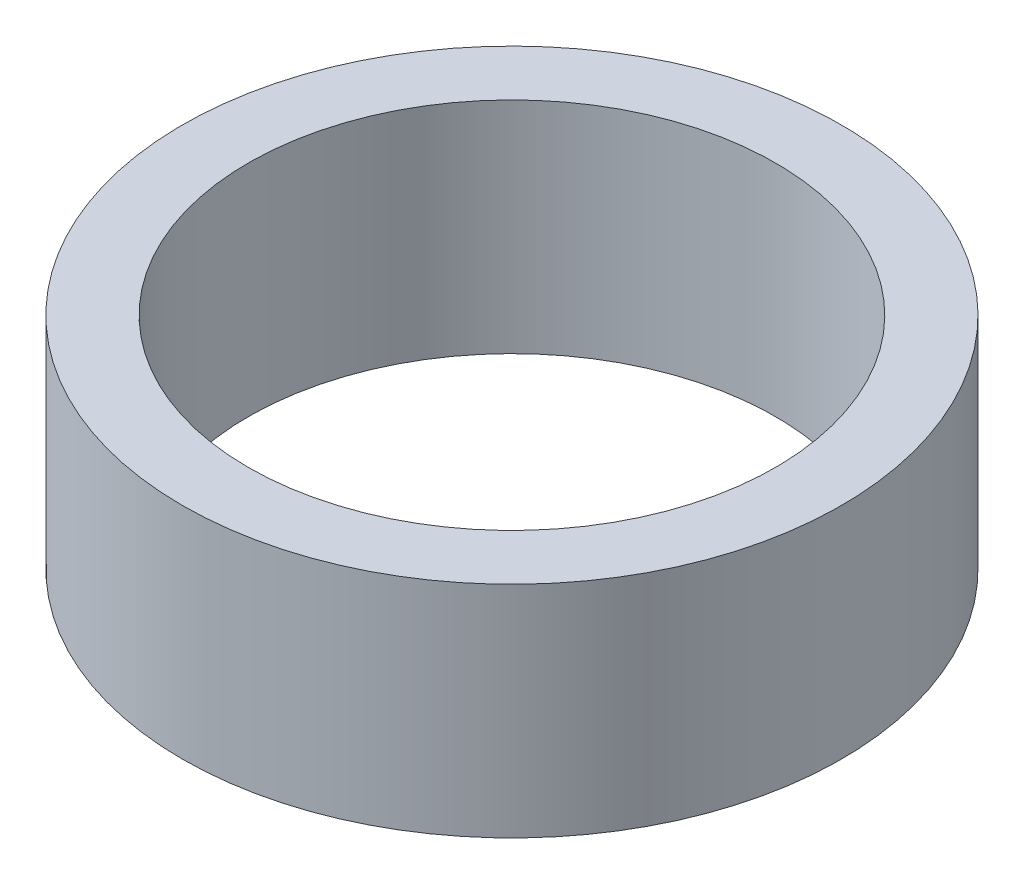
ISO-10303-21;
HEADER;
FILE_DESCRIPTION(('STEP AP214'),'2;1');
FILE_NAME('part.step','',(''),(''),'','','');
FILE_SCHEMA(('AUTOMOTIVE_DESIGN { 1 0 10303 214 1 1 1 1 }'));
ENDSEC;
DATA;
#1=APPLICATION_CONTEXT('core data for automotive mechanical design processes');
#2=APPLICATION_PROTOCOL_DEFINITION('international standard','automotive_design',2000,#1);
#3=PRODUCT_CONTEXT('',#1,'mechanical');
#4=PRODUCT('Part','Part','',(#3));
#5=PRODUCT_RELATED_PRODUCT_CATEGORY('part','',(#4));
#6=PRODUCT_DEFINITION_FORMATION('','',#4);
#7=PRODUCT_DEFINITION_CONTEXT('part definition',#1,'design');
#8=PRODUCT_DEFINITION('design','',#6,#7);
#9=PRODUCT_DEFINITION_SHAPE('','',#8);
#10=(LENGTH_UNIT() NAMED_UNIT(*) SI_UNIT(.MILLI.,.METRE.));
#11=(NAMED_UNIT(*) PLANE_ANGLE_UNIT() SI_UNIT($,.RADIAN.));
#12=(NAMED_UNIT(*) SI_UNIT($,.STERADIAN.) SOLID_ANGLE_UNIT());
#13=UNCERTAINTY_MEASURE_WITH_UNIT(LENGTH_MEASURE(1.E-05),#10,'distance_accuracy_value','');
#14=(GEOMETRIC_REPRESENTATION_CONTEXT(3) GLOBAL_UNCERTAINTY_ASSIGNED_CONTEXT((#13)) GLOBAL_UNIT_ASSIGNED_CONTEXT((#10,
#11,#12)) REPRESENTATION_CONTEXT('',''));
#15=CARTESIAN_POINT('',(0.,0.,0.));
#16=DIRECTION('',(0.,0.,1.));
#17=DIRECTION('',(1.,0.,0.));
#18=AXIS2_PLACEMENT_3D('',#15,#16,#17);
#19=CARTESIAN_POINT('',(0.,25.,0.));
#20=DIRECTION('',(0.,-1.,0.));
#21=DIRECTION('',(0.,0.,-1.));
#22=AXIS2_PLACEMENT_3D('',#19,#20,#21);
#23=CYLINDRICAL_SURFACE('',#22,37.5);
#24=CARTESIAN_POINT('',(0.,25.,0.));
#25=DIRECTION('',(0.,1.,0.));
#26=DIRECTION('',(0.,0.,1.));
#27=AXIS2_PLACEMENT_3D('',#24,#25,#26);
#28=CIRCLE('',#27,37.5);
#29=CARTESIAN_POINT('',(0.,25.,37.5));
#30=VERTEX_POINT('',#29);
#31=EDGE_CURVE('E10',#30,#30,#28,.T.);
#32=ORIENTED_EDGE('',*,*,#31,.F.);
#33=EDGE_LOOP('',(#32));
#34=FACE_BOUND('',#33,.T.);
#35=CARTESIAN_POINT('',(0.,0.,0.));
#36=DIRECTION('',(0.,1.,0.));
#37=DIRECTION('',(0.,0.,1.));
#38=AXIS2_PLACEMENT_3D('',#35,#36,#37);
#39=CIRCLE('',#38,37.5);
#40=CARTESIAN_POINT('',(0.,0.,37.5));
#41=VERTEX_POINT('',#40);
#42=EDGE_CURVE('E37',#41,#41,#39,.T.);
#43=ORIENTED_EDGE('',*,*,#42,.T.);
#44=EDGE_LOOP('',(#43));
#45=FACE_BOUND('',#44,.T.);
#46=ADVANCED_FACE('F40',(#34,#45),#23,.T.);
#47=CARTESIAN_POINT('',(0.,25.,0.));
#48=DIRECTION('',(0.,1.,0.));
#49=DIRECTION('',(0.,0.,1.));
#50=AXIS2_PLACEMENT_3D('',#47,#48,#49);
#51=PLANE('',#50);
#52=CARTESIAN_POINT('',(0.,25.,0.));
#53=DIRECTION('',(0.,1.,0.));
#54=DIRECTION('',(0.,0.,1.));
#55=AXIS2_PLACEMENT_3D('',#52,#53,#54);
#56=CIRCLE('',#55,30.);
#57=CARTESIAN_POINT('',(0.,25.,30.));
#58=VERTEX_POINT('',#57);
#59=EDGE_CURVE('E50',#58,#58,#56,.T.);
#60=ORIENTED_EDGE('',*,*,#59,.F.);
#61=EDGE_LOOP('',(#60));
#62=FACE_BOUND('',#61,.T.);
#63=ORIENTED_EDGE('',*,*,#31,.T.);
#64=EDGE_LOOP('',(#63));
#65=FACE_BOUND('',#64,.T.);
#66=ADVANCED_FACE('F59',(#62,#65),#51,.T.);
#67=CARTESIAN_POINT('',(0.,0.,0.));
#68=DIRECTION('',(0.,1.,0.));
#69=DIRECTION('',(0.,0.,1.));
#70=AXIS2_PLACEMENT_3D('',#67,#68,#69);
#71=PLANE('',#70);
#72=CARTESIAN_POINT('',(0.,0.,0.));
#73=DIRECTION('',(0.,1.,0.));
#74=DIRECTION('',(0.,0.,1.));
#75=AXIS2_PLACEMENT_3D('',#72,#73,#74);
#76=CIRCLE('',#75,30.);
#77=CARTESIAN_POINT('',(0.,0.,30.));
#78=VERTEX_POINT('',#77);
#79=EDGE_CURVE('E47',#78,#78,#76,.T.);
#80=ORIENTED_EDGE('',*,*,#79,.T.);
#81=EDGE_LOOP('',(#80));
#82=FACE_BOUND('',#81,.T.);
#83=ORIENTED_EDGE('',*,*,#42,.F.);
#84=EDGE_LOOP('',(#83));
#85=FACE_BOUND('',#84,.T.);
#86=ADVANCED_FACE('F58',(#82,#85),#71,.F.);
#87=CARTESIAN_POINT('',(0.,25.,0.));
#88=DIRECTION('',(0.,-1.,0.));
#89=DIRECTION('',(0.,0.,-1.));
#90=AXIS2_PLACEMENT_3D('',#87,#88,#89);
#91=CYLINDRICAL_SURFACE('',#90,30.);
#92=ORIENTED_EDGE('',*,*,#59,.T.);
#93=EDGE_LOOP('',(#92));
#94=FACE_BOUND('',#93,.T.);
#95=ORIENTED_EDGE('',*,*,#79,.F.);
#96=EDGE_LOOP('',(#95));
#97=FACE_BOUND('',#96,.T.);
#98=ADVANCED_FACE('F54',(#94,#97),#91,.F.);
#99=CLOSED_SHELL('',(#46,#66,#86,#98));
#100=MANIFOLD_SOLID_BREP('B2',#99);
#101=ADVANCED_BREP_SHAPE_REPRESENTATION('',(#18,#100),#14);
#102=SHAPE_DEFINITION_REPRESENTATION(#9,#101);
ENDSEC;
END-ISO-10303-21;
